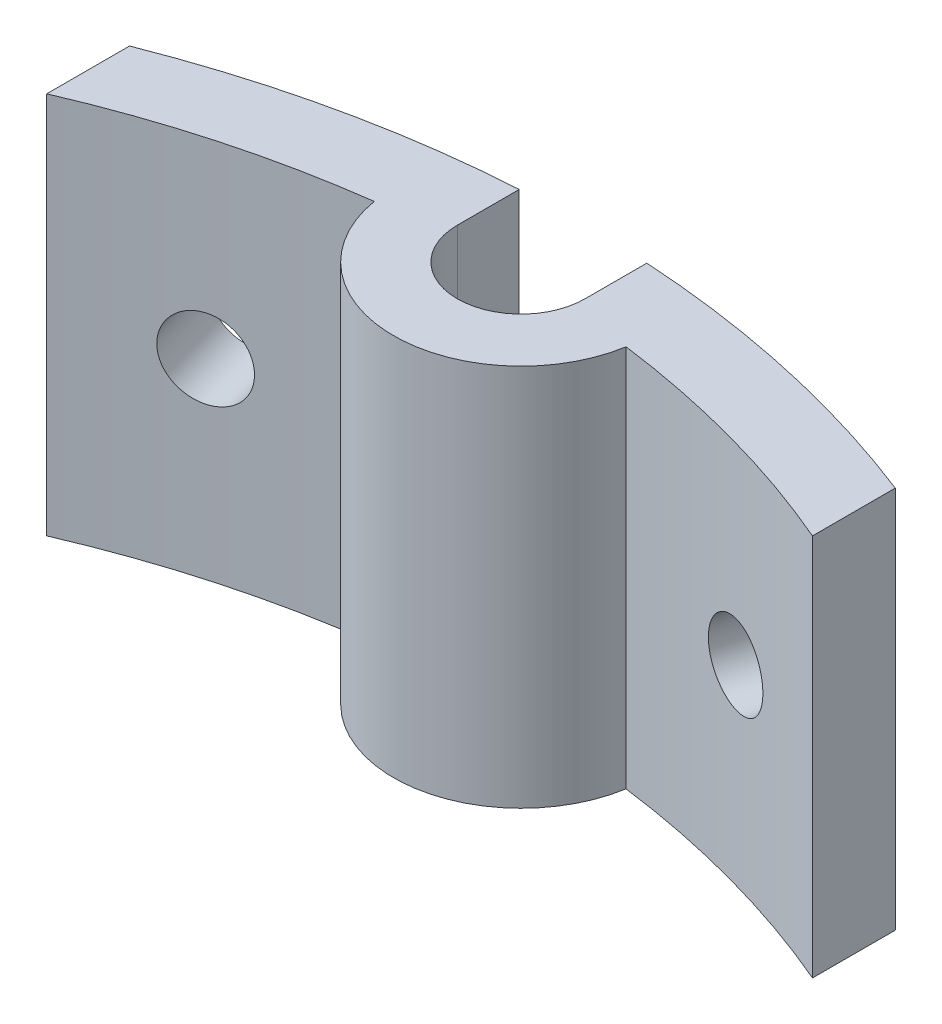
ISO-10303-21;
HEADER;
FILE_DESCRIPTION(('STEP AP214'),'2;1');
FILE_NAME('part.step','',(''),(''),'','','');
FILE_SCHEMA(('AUTOMOTIVE_DESIGN { 1 0 10303 214 1 1 1 1 }'));
ENDSEC;
DATA;
#1=APPLICATION_CONTEXT('core data for automotive mechanical design processes');
#2=APPLICATION_PROTOCOL_DEFINITION('international standard','automotive_design',2000,#1);
#3=PRODUCT_CONTEXT('',#1,'mechanical');
#4=PRODUCT('Part','Part','',(#3));
#5=PRODUCT_RELATED_PRODUCT_CATEGORY('part','',(#4));
#6=PRODUCT_DEFINITION_FORMATION('','',#4);
#7=PRODUCT_DEFINITION_CONTEXT('part definition',#1,'design');
#8=PRODUCT_DEFINITION('design','',#6,#7);
#9=PRODUCT_DEFINITION_SHAPE('','',#8);
#10=(LENGTH_UNIT() NAMED_UNIT(*) SI_UNIT(.MILLI.,.METRE.));
#11=(NAMED_UNIT(*) PLANE_ANGLE_UNIT() SI_UNIT($,.RADIAN.));
#12=(NAMED_UNIT(*) SI_UNIT($,.STERADIAN.) SOLID_ANGLE_UNIT());
#13=UNCERTAINTY_MEASURE_WITH_UNIT(LENGTH_MEASURE(1.E-05),#10,'distance_accuracy_value','');
#14=(GEOMETRIC_REPRESENTATION_CONTEXT(3) GLOBAL_UNCERTAINTY_ASSIGNED_CONTEXT((#13)) GLOBAL_UNIT_ASSIGNED_CONTEXT((#10,
#11,#12)) REPRESENTATION_CONTEXT('',''));
#15=CARTESIAN_POINT('',(0.,0.,0.));
#16=DIRECTION('',(0.,0.,1.));
#17=DIRECTION('',(1.,0.,0.));
#18=AXIS2_PLACEMENT_3D('',#15,#16,#17);
#19=CARTESIAN_POINT('',(0.,15.,0.));
#20=DIRECTION('',(0.,-1.,0.));
#21=DIRECTION('',(0.,0.,-1.));
#22=AXIS2_PLACEMENT_3D('',#19,#20,#21);
#23=CYLINDRICAL_SURFACE('',#22,41.);
#24=CARTESIAN_POINT('',(-12.6932776888419,7.5,-38.9856473784129));
#25=CARTESIAN_POINT('',(-12.6932740943222,7.41296920330301,-38.9856488107161));
#26=CARTESIAN_POINT('',(-12.6862799488873,7.32587609288315,-38.9879279146434));
#27=CARTESIAN_POINT('',(-12.6584708925541,7.15409075191891,-38.9969655252901));
#28=CARTESIAN_POINT('',(-12.6376395469426,7.06940150135863,-39.0037293585928));
#29=CARTESIAN_POINT('',(-12.5827331176201,6.90493733147452,-39.0214768421287));
#30=CARTESIAN_POINT('',(-12.5486646029322,6.82515999729659,-39.0324583992604));
#31=CARTESIAN_POINT('',(-12.4682318097364,6.67276484779085,-39.0582253849336));
#32=CARTESIAN_POINT('',(-12.4218704999239,6.60014530966438,-39.0730098950408));
#33=CARTESIAN_POINT('',(-12.3180986526609,6.46405856421499,-39.1058486686417));
#34=CARTESIAN_POINT('',(-12.260682039252,6.4005964234765,-39.1239047298457));
#35=CARTESIAN_POINT('',(-12.1364022322613,6.28466884951612,-39.1626348478834));
#36=CARTESIAN_POINT('',(-12.0695386595797,6.23220385781203,-39.1833090097762));
#37=CARTESIAN_POINT('',(-11.9282041220886,6.13974881672786,-39.2265649945904));
#38=CARTESIAN_POINT('',(-11.8537310249329,6.09976227686444,-39.2491473519194));
#39=CARTESIAN_POINT('',(-11.6992749179023,6.03342186665954,-39.2954636093574));
#40=CARTESIAN_POINT('',(-11.6192919365982,6.007067925634,-39.319197503495));
#41=CARTESIAN_POINT('',(-11.456105221743,5.96875298891944,-39.3670531759616));
#42=CARTESIAN_POINT('',(-11.3729030601335,5.95678505778418,-39.3911747616971));
#43=CARTESIAN_POINT('',(-11.20559540684,5.94756048177393,-39.4390948495184));
#44=CARTESIAN_POINT('',(-11.1214899199222,5.95030375931665,-39.4628933533072));
#45=CARTESIAN_POINT('',(-10.9548107113,5.97041792427225,-39.5094875810396));
#46=CARTESIAN_POINT('',(-10.8722362288513,5.9877813365228,-39.5322838111717));
#47=CARTESIAN_POINT('',(-10.7109322736086,6.03663131288564,-39.5762924457383));
#48=CARTESIAN_POINT('',(-10.6322028118191,6.06811791741597,-39.59750484564));
#49=CARTESIAN_POINT('',(-10.4808263159061,6.14432904955599,-39.6378408092884));
#50=CARTESIAN_POINT('',(-10.4081808590665,6.1890569964503,-39.6569638317511));
#51=CARTESIAN_POINT('',(-10.2710858949767,6.29047863153095,-39.6926922892367));
#52=CARTESIAN_POINT('',(-10.2066364194144,6.34717236597796,-39.7092977145259));
#53=CARTESIAN_POINT('',(-10.0877586593774,6.47095854140619,-39.7396640684885));
#54=CARTESIAN_POINT('',(-10.0333366710453,6.53805746732832,-39.7534232106745));
#55=CARTESIAN_POINT('',(-9.93614543448759,6.68072649316881,-39.7778271532198));
#56=CARTESIAN_POINT('',(-9.89337618850272,6.75629659471609,-39.7884719529802));
#57=CARTESIAN_POINT('',(-9.82073872359414,6.91376658573379,-39.8064630192458));
#58=CARTESIAN_POINT('',(-9.79087072124022,6.99566658143528,-39.8138092303785));
#59=CARTESIAN_POINT('',(-9.74491314036393,7.1634698132238,-39.8250829575696));
#60=CARTESIAN_POINT('',(-9.72882350247687,7.2493730320611,-39.8290104883576));
#61=CARTESIAN_POINT('',(-9.71090156025898,7.42268726695,-39.8333839614887));
#62=CARTESIAN_POINT('',(-9.70906043597044,7.5100973166659,-39.8338320576336));
#63=CARTESIAN_POINT('',(-9.71966645828371,7.68399400371782,-39.8312454310651));
#64=CARTESIAN_POINT('',(-9.73211357819193,7.77048064277866,-39.8282107148583));
#65=CARTESIAN_POINT('',(-9.77092427789576,7.94005009710696,-39.8187070810392));
#66=CARTESIAN_POINT('',(-9.79728384265254,8.02313388696332,-39.8122391542255));
#67=CARTESIAN_POINT('',(-9.86314438596352,8.18356915630723,-39.7959737504565));
#68=CARTESIAN_POINT('',(-9.90264540742929,8.26092061707566,-39.786176262629));
#69=CARTESIAN_POINT('',(-9.99365852589333,8.40773727871507,-39.7634126098797));
#70=CARTESIAN_POINT('',(-10.0451765274076,8.47719857774382,-39.750444887119));
#71=CARTESIAN_POINT('',(-10.1587152908784,8.60622395254846,-39.7215800990428));
#72=CARTESIAN_POINT('',(-10.2207360929526,8.66578799051798,-39.7056830225379));
#73=CARTESIAN_POINT('',(-10.3535191669577,8.77335838962047,-39.671265901518));
#74=CARTESIAN_POINT('',(-10.4242858386643,8.82135889739649,-39.6527445361127));
#75=CARTESIAN_POINT('',(-10.5724937618152,8.90439966932493,-39.6134856404986));
#76=CARTESIAN_POINT('',(-10.6499349935617,8.93943997172349,-39.59274811683));
#77=CARTESIAN_POINT('',(-10.8092442509176,8.99555540384067,-39.5495517370209));
#78=CARTESIAN_POINT('',(-10.8911110730988,9.01663430955452,-39.5270933481401));
#79=CARTESIAN_POINT('',(-11.0569471500589,9.04424097096257,-39.4810248438103));
#80=CARTESIAN_POINT('',(-11.1409163996839,9.05076876232489,-39.4574147311847));
#81=CARTESIAN_POINT('',(-11.3085119273078,9.04908747118955,-39.4097087601274));
#82=CARTESIAN_POINT('',(-11.3921383867972,9.04088759258394,-39.3856132143659));
#83=CARTESIAN_POINT('',(-11.5567343350998,9.01000269645623,-39.3376313884482));
#84=CARTESIAN_POINT('',(-11.6377038187227,8.98731765063964,-39.3137451087009));
#85=CARTESIAN_POINT('',(-11.7947092429782,8.92810796094027,-39.2669269303317));
#86=CARTESIAN_POINT('',(-11.8707451123322,8.89158311715824,-39.2439950455003));
#87=CARTESIAN_POINT('',(-12.0157547342817,8.80573290441396,-39.1998391614102));
#88=CARTESIAN_POINT('',(-12.0847287293487,8.75640797515214,-39.1786151035181));
#89=CARTESIAN_POINT('',(-12.2137349756549,8.64632724556695,-39.1385902959792));
#90=CARTESIAN_POINT('',(-12.2737625789006,8.58556554023827,-39.1197908066669));
#91=CARTESIAN_POINT('',(-12.3831850113173,8.45433037855167,-39.0852917362146));
#92=CARTESIAN_POINT('',(-12.4325772096352,8.38385452628498,-39.0695929221601));
#93=CARTESIAN_POINT('',(-12.5193767433758,8.23515489943092,-39.0418658655139));
#94=CARTESIAN_POINT('',(-12.5567750574187,8.15692535040786,-39.0298403861975));
#95=CARTESIAN_POINT('',(-12.6184692830087,7.99503966568907,-39.0099383964089));
#96=CARTESIAN_POINT('',(-12.6427807700006,7.91139011417551,-39.0020569541218));
#97=CARTESIAN_POINT('',(-12.6712123189035,7.77267916038253,-38.9928262867207));
#98=CARTESIAN_POINT('',(-12.6794766481556,7.71851750278245,-38.9901385756715));
#99=CARTESIAN_POINT('',(-12.6905104635212,7.60957879905299,-38.9865486709941));
#100=CARTESIAN_POINT('',(-12.6932799522473,7.55480175321623,-38.9856464765168));
#101=CARTESIAN_POINT('',(-12.6932776888419,7.5,-38.9856473784129));
#102=B_SPLINE_CURVE_WITH_KNOTS('',3,(#24,#25,#26,#27,#28,#29,#30,#31,#32,#33,#34,#35,#36,#37,
#38,#39,#40,#41,#42,#43,#44,#45,#46,#47,#48,#49,#50,#51,#52,#53,#54,#55,#56,#57,#58,#59,#60,#61,
#62,#63,#64,#65,#66,#67,#68,#69,#70,#71,#72,#73,#74,#75,#76,#77,#78,#79,#80,#81,#82,#83,#84,#85,
#86,#87,#88,#89,#90,#91,#92,#93,#94,#95,#96,#97,#98,#99,#100,#101),.UNSPECIFIED.,.T.,.F.,(4,2,2,
2,2,2,2,2,2,2,2,2,2,2,2,2,2,2,2,2,2,2,2,2,2,2,2,2,2,2,2,2,2,2,2,2,2,2,4),(0.,0.260892351985126,
0.522095126306809,0.783168442430555,1.04417876699429,1.30533295356009,1.56649762303791,
1.82773567801621,2.08897237847994,2.35008308704713,2.61119241859998,2.87216832797188,
3.1331449842148,3.39418909079418,3.65523420660912,3.9164426751835,4.17765119398579,
4.43886409745625,4.70007587547375,4.96112594811477,5.22217553305726,5.48314982199075,
5.74412496310752,6.00522860488978,6.26633324403448,6.52756977562868,6.7888055362961,
7.04997061433425,7.31113505219604,7.57213633505828,7.8331381277468,8.09414369043597,
8.35514028841371,8.61627201495139,8.87746826296102,9.13886051536125,9.39994097690464,
9.56422035421011,9.72849965340197),.UNSPECIFIED.);
#103=CARTESIAN_POINT('',(-12.6932776888419,7.5,-38.9856473784129));
#104=VERTEX_POINT('',#103);
#105=EDGE_CURVE('E11',#104,#104,#102,.T.);
#106=ORIENTED_EDGE('',*,*,#105,.T.);
#107=EDGE_LOOP('',(#106));
#108=FACE_BOUND('',#107,.T.);
#109=CARTESIAN_POINT('',(0.,0.,0.));
#110=DIRECTION('',(0.,1.,0.));
#111=DIRECTION('',(0.,0.,-1.));
#112=AXIS2_PLACEMENT_3D('',#109,#110,#111);
#113=CIRCLE('',#112,41.);
#114=CARTESIAN_POINT('',(-2.5,0.,-40.9237095092808));
#115=VERTEX_POINT('',#114);
#116=CARTESIAN_POINT('',(-15.,0.,-38.1575680566778));
#117=VERTEX_POINT('',#116);
#118=EDGE_CURVE('E148',#115,#117,#113,.T.);
#119=ORIENTED_EDGE('',*,*,#118,.T.);
#120=DIRECTION('',(0.,-1.,0.));
#121=VECTOR('',#120,1.);
#122=CARTESIAN_POINT('',(-15.,15.,-38.1575680566778));
#123=LINE('',#122,#121);
#124=CARTESIAN_POINT('',(-15.,15.,-38.1575680566778));
#125=VERTEX_POINT('',#124);
#126=EDGE_CURVE('E187',#125,#117,#123,.T.);
#127=ORIENTED_EDGE('',*,*,#126,.F.);
#128=CARTESIAN_POINT('',(0.,15.,0.));
#129=DIRECTION('',(0.,1.,0.));
#130=DIRECTION('',(0.,0.,-1.));
#131=AXIS2_PLACEMENT_3D('',#128,#129,#130);
#132=CIRCLE('',#131,41.);
#133=CARTESIAN_POINT('',(-2.5,15.,-40.9237095092808));
#134=VERTEX_POINT('',#133);
#135=EDGE_CURVE('E168',#134,#125,#132,.T.);
#136=ORIENTED_EDGE('',*,*,#135,.F.);
#137=DIRECTION('',(0.,-1.,0.));
#138=VECTOR('',#137,1.);
#139=CARTESIAN_POINT('',(-2.5,15.,-40.9237095092808));
#140=LINE('',#139,#138);
#141=EDGE_CURVE('E144',#134,#115,#140,.T.);
#142=ORIENTED_EDGE('',*,*,#141,.T.);
#143=EDGE_LOOP('',(#119,#127,#136,#142));
#144=FACE_BOUND('',#143,.T.);
#145=ADVANCED_FACE('F35',(#108,#144),#23,.T.);
#146=CARTESIAN_POINT('',(-15.,15.,-38.1575680566778));
#147=DIRECTION('',(1.,0.,0.));
#148=DIRECTION('',(0.,0.,-1.));
#149=AXIS2_PLACEMENT_3D('',#146,#147,#148);
#150=PLANE('',#149);
#151=DIRECTION('',(0.,0.,1.));
#152=VECTOR('',#151,1.);
#153=CARTESIAN_POINT('',(-15.,0.,-38.1575680566778));
#154=LINE('',#153,#152);
#155=CARTESIAN_POINT('',(-15.,0.,-34.9141805001922));
#156=VERTEX_POINT('',#155);
#157=EDGE_CURVE('E151',#117,#156,#154,.T.);
#158=ORIENTED_EDGE('',*,*,#157,.T.);
#159=DIRECTION('',(0.,-1.,0.));
#160=VECTOR('',#159,1.);
#161=CARTESIAN_POINT('',(-15.,15.,-34.9141805001922));
#162=LINE('',#161,#160);
#163=CARTESIAN_POINT('',(-15.,15.,-34.9141805001922));
#164=VERTEX_POINT('',#163);
#165=EDGE_CURVE('E184',#164,#156,#162,.T.);
#166=ORIENTED_EDGE('',*,*,#165,.F.);
#167=DIRECTION('',(0.,0.,1.));
#168=VECTOR('',#167,1.);
#169=CARTESIAN_POINT('',(-15.,15.,-38.1575680566778));
#170=LINE('',#169,#168);
#171=EDGE_CURVE('E105',#125,#164,#170,.T.);
#172=ORIENTED_EDGE('',*,*,#171,.F.);
#173=ORIENTED_EDGE('',*,*,#126,.T.);
#174=EDGE_LOOP('',(#158,#166,#172,#173));
#175=FACE_BOUND('',#174,.T.);
#176=ADVANCED_FACE('F231',(#175),#150,.F.);
#177=CARTESIAN_POINT('',(0.,15.,0.));
#178=DIRECTION('',(0.,-1.,0.));
#179=DIRECTION('',(0.,0.,-1.));
#180=AXIS2_PLACEMENT_3D('',#177,#178,#179);
#181=CYLINDRICAL_SURFACE('',#180,38.);
#182=CARTESIAN_POINT('',(-11.8723745494248,7.5,-36.0977384687486));
#183=CARTESIAN_POINT('',(-11.8723709652763,7.58702531627144,-36.0977399302551));
#184=CARTESIAN_POINT('',(-11.8653837479687,7.67411281230455,-36.1000400349502));
#185=CARTESIAN_POINT('',(-11.8376019343019,7.84588670305372,-36.1091593083377));
#186=CARTESIAN_POINT('',(-11.8167909520593,7.93057012375446,-36.115983840003));
#187=CARTESIAN_POINT('',(-11.7619370288759,8.0950226039705,-36.1338852727202));
#188=CARTESIAN_POINT('',(-11.7279006910088,8.17479409289616,-36.144960051701));
#189=CARTESIAN_POINT('',(-11.6475409986533,8.32717870992631,-36.1709353366461));
#190=CARTESIAN_POINT('',(-11.601220596216,8.3997935521408,-36.1858349234222));
#191=CARTESIAN_POINT('',(-11.4975313500649,8.53587800681484,-36.2189139437223));
#192=CARTESIAN_POINT('',(-11.440155624859,8.59934187992197,-36.237095419642));
#193=CARTESIAN_POINT('',(-11.3159559204713,8.71527417701227,-36.2760715732782));
#194=CARTESIAN_POINT('',(-11.2491315607472,8.76774215792601,-36.2968663562415));
#195=CARTESIAN_POINT('',(-11.1078656449504,8.86020680826592,-36.3403463927313));
#196=CARTESIAN_POINT('',(-11.0334215805399,8.90019935324139,-36.3630322683294));
#197=CARTESIAN_POINT('',(-10.8790129853868,8.96655131598373,-36.4095258246464));
#198=CARTESIAN_POINT('',(-10.79904848615,8.99291081154895,-36.4333334989627));
#199=CARTESIAN_POINT('',(-10.6358926360269,9.03123421521328,-36.4812967140164));
#200=CARTESIAN_POINT('',(-10.552703122772,9.04320620047547,-36.5054520518594));
#201=CARTESIAN_POINT('',(-10.3854078784915,9.05243965418073,-36.5533975674633));
#202=CARTESIAN_POINT('',(-10.3013021528219,9.04970120857266,-36.5771877473569));
#203=CARTESIAN_POINT('',(-10.1346172190866,9.029598278333,-36.6237220791257));
#204=CARTESIAN_POINT('',(-10.0520371326735,9.01224249557375,-36.6464668448548));
#205=CARTESIAN_POINT('',(-9.89071056252407,8.96341103592015,-36.690337110367));
#206=CARTESIAN_POINT('',(-9.81196409088367,8.93193531447764,-36.7114626050412));
#207=CARTESIAN_POINT('',(-9.66054084150256,8.85574750068426,-36.75159989349));
#208=CARTESIAN_POINT('',(-9.58786589591894,8.81103143126238,-36.7706110498063));
#209=CARTESIAN_POINT('',(-9.45070556519534,8.70963516871442,-36.8061026354618));
#210=CARTESIAN_POINT('',(-9.38622021745501,8.65295492095436,-36.8225830532438));
#211=CARTESIAN_POINT('',(-9.26726136623228,8.52919002225526,-36.8527019806289));
#212=CARTESIAN_POINT('',(-9.2127951900412,8.46209782236178,-36.8663384113144));
#213=CARTESIAN_POINT('',(-9.11551850113775,8.31944009150533,-36.8905115569792));
#214=CARTESIAN_POINT('',(-9.07270799083074,8.24387455879375,-36.9010482713189));
#215=CARTESIAN_POINT('',(-8.99999483712286,8.08641075210741,-36.9188502147449));
#216=CARTESIAN_POINT('',(-8.9700924515321,8.00451235168669,-36.9261153784898));
#217=CARTESIAN_POINT('',(-8.92407665062895,7.83670960786266,-36.937263315923));
#218=CARTESIAN_POINT('',(-8.90796316622097,7.75080528453513,-36.9411461065603));
#219=CARTESIAN_POINT('',(-8.89000720312553,7.57749550780915,-36.9454714282082));
#220=CARTESIAN_POINT('',(-8.88815444868269,7.49009118078179,-36.9459164363589));
#221=CARTESIAN_POINT('',(-8.89874755379751,7.31620422648518,-36.9433663938737));
#222=CARTESIAN_POINT('',(-8.91119338214117,7.22972159720427,-36.9403713507475));
#223=CARTESIAN_POINT('',(-8.95000979742467,7.06016252472534,-36.9309858926464));
#224=CARTESIAN_POINT('',(-8.97637570192538,6.97708494625602,-36.9245966194192));
#225=CARTESIAN_POINT('',(-9.04225458762052,6.81665932633596,-36.9085190028975));
#226=CARTESIAN_POINT('',(-9.08176761902924,6.73931130677014,-36.8988306470026));
#227=CARTESIAN_POINT('',(-9.17281131327489,6.59249180772596,-36.8763030227877));
#228=CARTESIAN_POINT('',(-9.22434884978267,6.5230248672608,-36.863461952034));
#229=CARTESIAN_POINT('',(-9.33792832428368,6.39398506151654,-36.83485462385));
#230=CARTESIAN_POINT('',(-9.39997030831145,6.33441223959956,-36.8190883536004));
#231=CARTESIAN_POINT('',(-9.53279998098714,6.22681635552246,-36.7849211103121));
#232=CARTESIAN_POINT('',(-9.60359279333194,6.17880010879961,-36.7665185927129));
#233=CARTESIAN_POINT('',(-9.75184995946425,6.09572696220404,-36.7274732423063));
#234=CARTESIAN_POINT('',(-9.82931429150557,6.0606700200917,-36.7068304168014));
#235=CARTESIAN_POINT('',(-9.98866036335314,6.00452256607581,-36.6637895927337));
#236=CARTESIAN_POINT('',(-10.0705407063846,5.98342766570326,-36.6413921481505));
#237=CARTESIAN_POINT('',(-10.2363954603395,5.95578872233021,-36.5954042285406));
#238=CARTESIAN_POINT('',(-10.3203698646658,5.94924463349572,-36.571813757272));
#239=CARTESIAN_POINT('',(-10.4879575750693,5.95089357144022,-36.524106164187));
#240=CARTESIAN_POINT('',(-10.5715710992716,5.95907588843405,-36.4999894376895));
#241=CARTESIAN_POINT('',(-10.7361325781745,5.98992328127629,-36.451924615298));
#242=CARTESIAN_POINT('',(-10.8170805277035,6.01258838522139,-36.4279765197312));
#243=CARTESIAN_POINT('',(-10.9740365664316,6.07175601490076,-36.3810010571435));
#244=CARTESIAN_POINT('',(-11.0500445905123,6.10825872299944,-36.3579737022615));
#245=CARTESIAN_POINT('',(-11.1949961809329,6.19406300165727,-36.3136036927578));
#246=CARTESIAN_POINT('',(-11.2639399841613,6.24336414284328,-36.2922609816496));
#247=CARTESIAN_POINT('',(-11.392894660668,6.35340224976613,-36.2519865083452));
#248=CARTESIAN_POINT('',(-11.4528999722915,6.41414628264646,-36.2330562482594));
#249=CARTESIAN_POINT('',(-11.5622823777341,6.54534870335935,-36.1983000927667));
#250=CARTESIAN_POINT('',(-11.6116568443087,6.61580948549043,-36.1824749648294));
#251=CARTESIAN_POINT('',(-11.6984310369473,6.76448606940571,-36.1545128282809));
#252=CARTESIAN_POINT('',(-11.7358212007639,6.84270799895053,-36.1423787651533));
#253=CARTESIAN_POINT('',(-11.7975085783218,7.00458336031184,-36.122290261607));
#254=CARTESIAN_POINT('',(-11.8218213346029,7.08823021144343,-36.1143308598716));
#255=CARTESIAN_POINT('',(-11.8502759179158,7.22700112448675,-36.1050008279273));
#256=CARTESIAN_POINT('',(-11.858552705421,7.2812253262943,-36.1022819517123));
#257=CARTESIAN_POINT('',(-11.869603149487,7.39029144703446,-36.0986503119099));
#258=CARTESIAN_POINT('',(-11.8723768091141,7.44513336562288,-36.0977375473162));
#259=CARTESIAN_POINT('',(-11.8723745494248,7.5,-36.0977384687486));
#260=B_SPLINE_CURVE_WITH_KNOTS('',3,(#182,#183,#184,#185,#186,#187,#188,#189,#190,#191,#192,
#193,#194,#195,#196,#197,#198,#199,#200,#201,#202,#203,#204,#205,#206,#207,#208,#209,#210,#211,
#212,#213,#214,#215,#216,#217,#218,#219,#220,#221,#222,#223,#224,#225,#226,#227,#228,#229,#230,
#231,#232,#233,#234,#235,#236,#237,#238,#239,#240,#241,#242,#243,#244,#245,#246,#247,#248,#249,
#250,#251,#252,#253,#254,#255,#256,#257,#258,#259),.UNSPECIFIED.,.T.,.F.,(4,2,2,2,2,2,2,2,2,2,2,
2,2,2,2,2,2,2,2,2,2,2,2,2,2,2,2,2,2,2,2,2,2,2,2,2,2,2,4),(0.,0.260875671850712,
0.522061123611222,0.783116339526818,1.04410887659001,1.30526439887587,1.5664304421626,
1.8276827371571,2.08893354127328,2.35003761030216,2.61114015377622,2.87208736962125,
3.13303540875581,3.39406190983891,3.65508960291545,3.91630744019161,4.17752533137475,
4.43874843954317,4.69997023872592,4.9610037934896,5.22203677841438,5.48298201288239,
5.74392824401912,6.00502400914453,6.26612091852214,6.52737143336083,6.78862109667106,
7.04978860643863,7.31095529354619,7.57193212380614,7.83290946036399,8.09389023643551,
8.35486225802457,8.61599598782433,8.87719417879363,9.13860026336128,9.39969497562102,
9.56416870227314,9.72864233728614),.UNSPECIFIED.);
#261=CARTESIAN_POINT('',(-11.8723745494248,7.5,-36.0977384687486));
#262=VERTEX_POINT('',#261);
#263=EDGE_CURVE('E214',#262,#262,#260,.T.);
#264=ORIENTED_EDGE('',*,*,#263,.T.);
#265=EDGE_LOOP('',(#264));
#266=FACE_BOUND('',#265,.T.);
#267=CARTESIAN_POINT('',(0.,0.,0.));
#268=DIRECTION('',(0.,-1.,0.));
#269=DIRECTION('',(0.,0.,-1.));
#270=AXIS2_PLACEMENT_3D('',#267,#268,#269);
#271=CIRCLE('',#270,38.);
#272=CARTESIAN_POINT('',(-4.93206397992168,0.,-37.6785714285714));
#273=VERTEX_POINT('',#272);
#274=EDGE_CURVE('E154',#156,#273,#271,.T.);
#275=ORIENTED_EDGE('',*,*,#274,.T.);
#276=DIRECTION('',(0.,-1.,0.));
#277=VECTOR('',#276,1.);
#278=CARTESIAN_POINT('',(-4.93206397992168,15.,-37.6785714285714));
#279=LINE('',#278,#277);
#280=CARTESIAN_POINT('',(-4.93206397992168,15.,-37.6785714285714));
#281=VERTEX_POINT('',#280);
#282=EDGE_CURVE('E181',#281,#273,#279,.T.);
#283=ORIENTED_EDGE('',*,*,#282,.F.);
#284=CARTESIAN_POINT('',(0.,15.,0.));
#285=DIRECTION('',(0.,-1.,0.));
#286=DIRECTION('',(0.,0.,-1.));
#287=AXIS2_PLACEMENT_3D('',#284,#285,#286);
#288=CIRCLE('',#287,38.);
#289=EDGE_CURVE('E245',#164,#281,#288,.T.);
#290=ORIENTED_EDGE('',*,*,#289,.F.);
#291=ORIENTED_EDGE('',*,*,#165,.T.);
#292=EDGE_LOOP('',(#275,#283,#290,#291));
#293=FACE_BOUND('',#292,.T.);
#294=ADVANCED_FACE('F227',(#266,#293),#181,.F.);
#295=CARTESIAN_POINT('',(0.,15.,-38.5));
#296=DIRECTION('',(0.,-1.,0.));
#297=DIRECTION('',(0.,0.,-1.));
#298=AXIS2_PLACEMENT_3D('',#295,#296,#297);
#299=CYLINDRICAL_SURFACE('',#298,5.);
#300=CARTESIAN_POINT('',(0.,0.,-38.5));
#301=DIRECTION('',(0.,1.,0.));
#302=DIRECTION('',(0.,0.,1.));
#303=AXIS2_PLACEMENT_3D('',#300,#301,#302);
#304=CIRCLE('',#303,5.);
#305=CARTESIAN_POINT('',(4.93206397992167,0.,-37.6785714285714));
#306=VERTEX_POINT('',#305);
#307=EDGE_CURVE('E157',#273,#306,#304,.T.);
#308=ORIENTED_EDGE('',*,*,#307,.T.);
#309=DIRECTION('',(0.,-1.,0.));
#310=VECTOR('',#309,1.);
#311=CARTESIAN_POINT('',(4.93206397992167,15.,-37.6785714285714));
#312=LINE('',#311,#310);
#313=CARTESIAN_POINT('',(4.93206397992167,15.,-37.6785714285714));
#314=VERTEX_POINT('',#313);
#315=EDGE_CURVE('E178',#314,#306,#312,.T.);
#316=ORIENTED_EDGE('',*,*,#315,.F.);
#317=CARTESIAN_POINT('',(0.,15.,-38.5));
#318=DIRECTION('',(0.,1.,0.));
#319=DIRECTION('',(0.,0.,-1.));
#320=AXIS2_PLACEMENT_3D('',#317,#318,#319);
#321=CIRCLE('',#320,5.);
#322=EDGE_CURVE('E256',#281,#314,#321,.T.);
#323=ORIENTED_EDGE('',*,*,#322,.F.);
#324=ORIENTED_EDGE('',*,*,#282,.T.);
#325=EDGE_LOOP('',(#308,#316,#323,#324));
#326=FACE_BOUND('',#325,.T.);
#327=ADVANCED_FACE('F224',(#326),#299,.T.);
#328=CARTESIAN_POINT('',(0.,15.,0.));
#329=DIRECTION('',(0.,-1.,0.));
#330=DIRECTION('',(0.,0.,-1.));
#331=AXIS2_PLACEMENT_3D('',#328,#329,#330);
#332=CYLINDRICAL_SURFACE('',#331,38.);
#333=CARTESIAN_POINT('',(8.890503760584,7.5,-36.9453507614022));
#334=CARTESIAN_POINT('',(8.89050757759311,7.58702531627144,-36.9453501190911));
#335=CARTESIAN_POINT('',(8.89765993618632,7.67411281230455,-36.9436309757385));
#336=CARTESIAN_POINT('',(8.92608461008965,7.84588670305372,-36.9367732624741));
#337=CARTESIAN_POINT('',(8.94737368222452,7.93057012375446,-36.9316306345477));
#338=CARTESIAN_POINT('',(9.00344211646426,8.0950226039705,-36.9180018098058));
#339=CARTESIAN_POINT('',(9.03821474656391,8.17479409289616,-36.9095172814847));
#340=CARTESIAN_POINT('',(9.12022222549975,8.32717870992631,-36.8893388528534));
#341=CARTESIAN_POINT('',(9.16745408017677,8.3997935521408,-36.8776457235963));
#342=CARTESIAN_POINT('',(9.27303948789473,8.53587800681484,-36.8512373342393));
#343=CARTESIAN_POINT('',(9.33139996782015,8.59934187992197,-36.8365201914323));
#344=CARTESIAN_POINT('',(9.4575310388976,8.71527417701227,-36.8043385191466));
#345=CARTESIAN_POINT('',(9.52530200905386,8.76774215792601,-36.7868738790097));
#346=CARTESIAN_POINT('',(9.66831662114903,8.86020680826593,-36.7495456957386));
#347=CARTESIAN_POINT('',(9.74356272359247,8.90019935324139,-36.7296813622567));
#348=CARTESIAN_POINT('',(9.89934005015086,8.96655131598373,-36.6880029557795));
#349=CARTESIAN_POINT('',(9.97987124410295,8.99291081154895,-36.6661888939113));
#350=CARTESIAN_POINT('',(10.143860983442,9.03123421521328,-36.621159272336));
#351=CARTESIAN_POINT('',(10.2273178592371,9.04320620047547,-36.597944506681));
#352=CARTESIAN_POINT('',(10.3948187578766,9.05243965418073,-36.5507224760136));
#353=CARTESIAN_POINT('',(10.4788627772876,9.04970120857266,-36.5267152156323));
#354=CARTESIAN_POINT('',(10.6451023248521,9.029598278333,-36.4786140306876));
#355=CARTESIAN_POINT('',(10.7272989229141,9.01224249557375,-36.454520166176));
#356=CARTESIAN_POINT('',(10.8875799715454,8.96341103592015,-36.4069717920511));
#357=CARTESIAN_POINT('',(10.9656644091401,8.93193531447764,-36.3835172844551));
#358=CARTESIAN_POINT('',(11.1155593104328,8.85574750068426,-36.3380033201848));
#359=CARTESIAN_POINT('',(11.1873678806106,8.81103143126238,-36.3159442850953));
#360=CARTESIAN_POINT('',(11.3226887850768,8.70963516871442,-36.2739816613569));
#361=CARTESIAN_POINT('',(11.3862010814783,8.65295492095437,-36.2540780825515));
#362=CARTESIAN_POINT('',(11.5032159396664,8.52919002225526,-36.2171202547706));
#363=CARTESIAN_POINT('',(11.5567111762147,8.46209782236178,-36.2000680919353));
#364=CARTESIAN_POINT('',(11.6521582714277,8.31944009150533,-36.1694584988191));
#365=CARTESIAN_POINT('',(11.6941101277103,8.24387455879375,-36.1559010692594));
#366=CARTESIAN_POINT('',(11.7653151369788,8.08641075210741,-36.1327935257515));
#367=CARTESIAN_POINT('',(11.7945680363323,8.00451235168669,-36.1232434918419));
#368=CARTESIAN_POINT('',(11.8395674346389,7.83670960786266,-36.1085198851569));
#369=CARTESIAN_POINT('',(11.8553140012716,7.75080528453513,-36.1033462904512));
#370=CARTESIAN_POINT('',(11.8728603330552,7.57749550780915,-36.0975798999869));
#371=CARTESIAN_POINT('',(11.8746701405203,7.49009118078179,-36.0969838058512));
#372=CARTESIAN_POINT('',(11.8643195793395,7.31620422648518,-36.1003871095244));
#373=CARTESIAN_POINT('',(11.8521592411905,7.22972159720427,-36.1043864973012));
#374=CARTESIAN_POINT('',(11.8142098507967,7.06016252472534,-36.1168221190374));
#375=CARTESIAN_POINT('',(11.7884253814386,6.97708494625602,-36.1252568610272));
#376=CARTESIAN_POINT('',(11.7239397865912,6.81665932633596,-36.1462360266595));
#377=CARTESIAN_POINT('',(11.6852386117676,6.73931130677014,-36.1587804659986));
#378=CARTESIAN_POINT('',(11.5959581080574,6.59249180772596,-36.1875109336576));
#379=CARTESIAN_POINT('',(11.54537198516,6.5230248672608,-36.2036990446532));
#380=CARTESIAN_POINT('',(11.4337272897981,6.39398506151654,-36.2391128590664));
#381=CARTESIAN_POINT('',(11.3726686714389,6.33441223959956,-36.2583385757958));
#382=CARTESIAN_POINT('',(11.2417275175291,6.22681635552246,-36.2991495629171));
#383=CARTESIAN_POINT('',(11.1718398119281,6.17880010879961,-36.3207362147996));
#384=CARTESIAN_POINT('',(11.0252119677175,6.09572696220404,-36.365513463488));
#385=CARTESIAN_POINT('',(10.9484718514437,6.06067002009171,-36.3887040550657));
#386=CARTESIAN_POINT('',(10.7903114689347,6.00452256607581,-36.4359160933006));
#387=CARTESIAN_POINT('',(10.7088926820256,5.98342766570326,-36.4599372763909));
#388=CARTESIAN_POINT('',(10.5436466026252,5.95578872233021,-36.508066492074));
#389=CARTESIAN_POINT('',(10.4598193177214,5.94924463349572,-36.532174524393));
#390=CARTESIAN_POINT('',(10.2921948319183,5.95089357144022,-36.5797527428917));
#391=CARTESIAN_POINT('',(10.2083976534491,5.95907588843405,-36.6032233800175));
#392=CARTESIAN_POINT('',(10.0431590095101,5.98992328127629,-36.6489059591853));
#393=CARTESIAN_POINT('',(9.96171754861068,6.01258838522139,-36.6711178987853));
#394=CARTESIAN_POINT('',(9.80352018708675,6.07175601490076,-36.7137264306232));
#395=CARTESIAN_POINT('',(9.72676434822906,6.10825872299944,-36.734122998932));
#396=CARTESIAN_POINT('',(9.58014701260373,6.19406300165727,-36.7726329743014));
#397=CARTESIAN_POINT('',(9.51028528465485,6.24336414284327,-36.7907464579265));
#398=CARTESIAN_POINT('',(9.37942728081271,6.35340224976613,-36.8243250913614));
#399=CARTESIAN_POINT('',(9.31843652511492,6.41414628264646,-36.8397885932079));
#400=CARTESIAN_POINT('',(9.20712701564556,6.54534870335935,-36.8677652632516));
#401=CARTESIAN_POINT('',(9.15681089998677,6.61580948549043,-36.8802777022132));
#402=CARTESIAN_POINT('',(9.06830292023112,6.76448606940571,-36.9021404355286));
#403=CARTESIAN_POINT('',(9.03012073797756,6.84270799895053,-36.9114882051327));
#404=CARTESIAN_POINT('',(8.96709017411045,7.00458336031183,-36.9268514256054));
#405=CARTESIAN_POINT('',(8.94222596419312,7.08823021144342,-36.9328708324827));
#406=CARTESIAN_POINT('',(8.91311825281082,7.22700112448675,-36.9399031824229));
#407=CARTESIAN_POINT('',(8.90464886402597,7.28122532629429,-36.9419444939838));
#408=CARTESIAN_POINT('',(8.89334041623096,7.39029144703445,-36.9446684855731));
#409=CARTESIAN_POINT('',(8.89050135408377,7.44513336562288,-36.9453511663585));
#410=CARTESIAN_POINT('',(8.890503760584,7.5,-36.9453507614022));
#411=B_SPLINE_CURVE_WITH_KNOTS('',3,(#333,#334,#335,#336,#337,#338,#339,#340,#341,#342,#343,
#344,#345,#346,#347,#348,#349,#350,#351,#352,#353,#354,#355,#356,#357,#358,#359,#360,#361,#362,
#363,#364,#365,#366,#367,#368,#369,#370,#371,#372,#373,#374,#375,#376,#377,#378,#379,#380,#381,
#382,#383,#384,#385,#386,#387,#388,#389,#390,#391,#392,#393,#394,#395,#396,#397,#398,#399,#400,
#401,#402,#403,#404,#405,#406,#407,#408,#409,#410),.UNSPECIFIED.,.T.,.F.,(4,2,2,2,2,2,2,2,2,2,2,
2,2,2,2,2,2,2,2,2,2,2,2,2,2,2,2,2,2,2,2,2,2,2,2,2,2,2,4),(0.,0.260875671850712,
0.522061123611222,0.783116339526818,1.04410887659001,1.30526439887587,1.5664304421626,
1.8276827371571,2.08893354127328,2.35003761030216,2.61114015377622,2.87208736962125,
3.13303540875581,3.39406190983891,3.65508960291545,3.91630744019161,4.17752533137475,
4.43874843954317,4.69997023872592,4.9610037934896,5.22203677841437,5.48298201288238,
5.74392824401911,6.00502400914453,6.26612091852214,6.52737143336083,6.78862109667106,
7.04978860643863,7.31095529354619,7.57193212380614,7.83290946036399,8.09389023643551,
8.35486225802457,8.61599598782433,8.87719417879363,9.13860026336128,9.39969497562102,
9.56416870227314,9.72864233728614),.UNSPECIFIED.);
#412=CARTESIAN_POINT('',(8.890503760584,7.5,-36.9453507614022));
#413=VERTEX_POINT('',#412);
#414=EDGE_CURVE('E152',#413,#413,#411,.T.);
#415=ORIENTED_EDGE('',*,*,#414,.T.);
#416=EDGE_LOOP('',(#415));
#417=FACE_BOUND('',#416,.T.);
#418=CARTESIAN_POINT('',(0.,0.,0.));
#419=DIRECTION('',(0.,-1.,0.));
#420=DIRECTION('',(0.,0.,1.));
#421=AXIS2_PLACEMENT_3D('',#418,#419,#420);
#422=CIRCLE('',#421,38.);
#423=CARTESIAN_POINT('',(15.,0.,-34.9141805001922));
#424=VERTEX_POINT('',#423);
#425=EDGE_CURVE('E159',#306,#424,#422,.T.);
#426=ORIENTED_EDGE('',*,*,#425,.T.);
#427=DIRECTION('',(0.,-1.,0.));
#428=VECTOR('',#427,1.);
#429=CARTESIAN_POINT('',(15.,15.,-34.9141805001922));
#430=LINE('',#429,#428);
#431=CARTESIAN_POINT('',(15.,15.,-34.9141805001922));
#432=VERTEX_POINT('',#431);
#433=EDGE_CURVE('E175',#432,#424,#430,.T.);
#434=ORIENTED_EDGE('',*,*,#433,.F.);
#435=CARTESIAN_POINT('',(0.,15.,0.));
#436=DIRECTION('',(0.,-1.,0.));
#437=DIRECTION('',(0.,0.,1.));
#438=AXIS2_PLACEMENT_3D('',#435,#436,#437);
#439=CIRCLE('',#438,38.);
#440=EDGE_CURVE('E253',#314,#432,#439,.T.);
#441=ORIENTED_EDGE('',*,*,#440,.F.);
#442=ORIENTED_EDGE('',*,*,#315,.T.);
#443=EDGE_LOOP('',(#426,#434,#441,#442));
#444=FACE_BOUND('',#443,.T.);
#445=ADVANCED_FACE('F219',(#417,#444),#332,.F.);
#446=CARTESIAN_POINT('',(15.,15.,-38.1575680566778));
#447=DIRECTION('',(-1.,0.,0.));
#448=DIRECTION('',(0.,0.,1.));
#449=AXIS2_PLACEMENT_3D('',#446,#447,#448);
#450=PLANE('',#449);
#451=DIRECTION('',(0.,0.,-1.));
#452=VECTOR('',#451,1.);
#453=CARTESIAN_POINT('',(15.,0.,-38.1575680566778));
#454=LINE('',#453,#452);
#455=CARTESIAN_POINT('',(15.,0.,-38.1575680566778));
#456=VERTEX_POINT('',#455);
#457=EDGE_CURVE('E161',#424,#456,#454,.T.);
#458=ORIENTED_EDGE('',*,*,#457,.T.);
#459=DIRECTION('',(0.,-1.,0.));
#460=VECTOR('',#459,1.);
#461=CARTESIAN_POINT('',(15.,15.,-38.1575680566778));
#462=LINE('',#461,#460);
#463=CARTESIAN_POINT('',(15.,15.,-38.1575680566778));
#464=VERTEX_POINT('',#463);
#465=EDGE_CURVE('E172',#464,#456,#462,.T.);
#466=ORIENTED_EDGE('',*,*,#465,.F.);
#467=DIRECTION('',(0.,0.,-1.));
#468=VECTOR('',#467,1.);
#469=CARTESIAN_POINT('',(15.,15.,-38.1575680566778));
#470=LINE('',#469,#468);
#471=EDGE_CURVE('E255',#432,#464,#470,.T.);
#472=ORIENTED_EDGE('',*,*,#471,.F.);
#473=ORIENTED_EDGE('',*,*,#433,.T.);
#474=EDGE_LOOP('',(#458,#466,#472,#473));
#475=FACE_BOUND('',#474,.T.);
#476=ADVANCED_FACE('F223',(#475),#450,.F.);
#477=CARTESIAN_POINT('',(0.,15.,0.));
#478=DIRECTION('',(0.,-1.,0.));
#479=DIRECTION('',(0.,0.,-1.));
#480=AXIS2_PLACEMENT_3D('',#477,#478,#479);
#481=CYLINDRICAL_SURFACE('',#480,41.);
#482=CARTESIAN_POINT('',(9.71140690000104,7.5,-39.8332596710665));
#483=CARTESIAN_POINT('',(9.71141071046942,7.41296920330301,-39.8332589984634));
#484=CARTESIAN_POINT('',(9.71855791471186,7.32587609288315,-39.8315183501378));
#485=CARTESIAN_POINT('',(9.74696280265398,7.15409075191891,-39.8245768545251));
#486=CARTESIAN_POINT('',(9.76823726556589,7.06940150135863,-39.8193718925903));
#487=CARTESIAN_POINT('',(9.82426937663228,6.90493733147452,-39.8055845185748));
#488=CARTESIAN_POINT('',(9.85902033697919,6.82515999729659,-39.7970037817158));
#489=CARTESIAN_POINT('',(9.94098041950654,6.67276484779085,-39.7766097471942));
#490=CARTESIAN_POINT('',(9.98818653376865,6.60014530966438,-39.7647972299807));
#491=CARTESIAN_POINT('',(10.0937158202482,6.46405856421499,-39.7381410668827));
#492=CARTESIAN_POINT('',(10.1520451055537,6.40059642347651,-39.7232957539085));
#493=CARTESIAN_POINT('',(10.2781148854528,6.28466884951612,-39.690862698779));
#494=CARTESIAN_POINT('',(10.3458557577249,6.23220385781203,-39.6732748465645));
#495=CARTESIAN_POINT('',(10.4888108780937,6.13974881672786,-39.6357200163769));
#496=CARTESIAN_POINT('',(10.5640272208096,6.09976227686444,-39.6157523712744));
#497=CARTESIAN_POINT('',(10.7197516945413,6.03342186665954,-39.5738981841108));
#498=CARTESIAN_POINT('',(10.8002597981172,6.007067925634,-39.5520116519997));
#499=CARTESIAN_POINT('',(10.9642192189706,5.96875298891944,-39.5068743325638));
#500=CARTESIAN_POINT('',(11.0476690980385,5.95678505778418,-39.4836242082968));
#501=CARTESIAN_POINT('',(11.2151671750605,5.94756048177393,-39.4363740245797));
#502=CARTESIAN_POINT('',(11.299215369857,5.95030375931665,-39.4123739690851));
#503=CARTESIAN_POINT('',(11.4654815541104,5.97041792427225,-39.3643267358797));
#504=CARTESIAN_POINT('',(11.5477004568242,5.9877813365228,-39.3402795885138));
#505=CARTESIAN_POINT('',(11.708035055228,6.03663131288564,-39.2928607900467));
#506=CARTESIAN_POINT('',(11.7861507391744,6.06811791741597,-39.2694891408788));
#507=CARTESIAN_POINT('',(11.9361103824295,6.14432904955599,-39.2241687384849));
#508=CARTESIAN_POINT('',(12.0079527155708,6.1890569964503,-39.2022203545726));
#509=CARTESIAN_POINT('',(12.1433426236341,6.29047863153095,-39.1604935688386));
#510=CARTESIAN_POINT('',(12.2068901664863,6.34717236597796,-39.1407151754066));
#511=CARTESIAN_POINT('',(12.3239662067501,6.47095854140619,-39.1040104334714));
#512=CARTESIAN_POINT('',(12.3774884097151,6.53805746732832,-39.0870858774213));
#513=CARTESIAN_POINT('',(12.472984230567,6.68072649316881,-39.0567175209432));
#514=CARTESIAN_POINT('',(12.5149578462333,6.75629659471609,-39.0432737211844));
#515=CARTESIAN_POINT('',(12.5861979639401,6.91376658573379,-39.0203668356948));
#516=CARTESIAN_POINT('',(12.6154642526661,6.99566658143527,-39.0109038167883));
#517=CARTESIAN_POINT('',(12.6604803025093,7.1634698132238,-38.996317815921));
#518=CARTESIAN_POINT('',(12.6762301218627,7.2493730320611,-38.9911948152609));
#519=CARTESIAN_POINT('',(12.6937728476758,7.42268726695,-38.9854872719071));
#520=CARTESIAN_POINT('',(12.6955743882455,7.5100973166659,-38.9848999216057));
#521=CARTESIAN_POINT('',(12.6851935977188,7.68399400371782,-38.9882789058253));
#522=CARTESIAN_POINT('',(12.6730112927474,7.77048064277866,-38.9922452318391));
#523=CARTESIAN_POINT('',(12.6350046019165,7.94005009710696,-39.0045773411214));
#524=CARTESIAN_POINT('',(12.6091841519331,8.02313388696332,-39.0129418550996));
#525=CARTESIAN_POINT('',(12.5446153792367,8.18356915630723,-39.0337516633029));
#526=CARTESIAN_POINT('',(12.5058670143093,8.26092061707566,-39.0461969708533));
#527=CARTESIAN_POINT('',(12.4164883616802,8.40773727871507,-39.0747106179938));
#528=CARTESIAN_POINT('',(12.3658522328731,8.47719857774382,-39.0907807384991));
#529=CARTESIAN_POINT('',(12.2541067353382,8.60622395254847,-39.1259541742401));
#530=CARTESIAN_POINT('',(12.1929973266054,8.66578799051798,-39.1450575010618));
#531=CARTESIAN_POINT('',(12.0619643661194,8.77335838962047,-39.1856314610339));
#532=CARTESIAN_POINT('',(11.9920363776483,8.82135889739649,-39.2071032851134));
#533=CARTESIAN_POINT('',(11.845338087006,8.90439966932493,-39.2516730157854));
#534=CARTESIAN_POINT('',(11.7685678050275,8.93943997172349,-39.2747709175789));
#535=CARTESIAN_POINT('',(11.6103569088587,8.99555540384067,-39.3218312941324));
#536=CARTESIAN_POINT('',(11.5289175639417,9.01663430955452,-39.3457935332735));
#537=CARTESIAN_POINT('',(11.363644980701,9.04424097096257,-39.3938443890585));
#538=CARTESIAN_POINT('',(11.2798117482458,9.05076876232489,-39.4179330053923));
#539=CARTESIAN_POINT('',(11.1121814672581,9.04908747118955,-39.4655167153155));
#540=CARTESIAN_POINT('',(11.028384428839,9.04088759258394,-39.48901217029));
#541=CARTESIAN_POINT('',(10.8631601262283,9.01000269645623,-39.5347834674407));
#542=CARTESIAN_POINT('',(10.7817328666662,8.98731765063964,-39.5570593072345));
#543=CARTESIAN_POINT('',(10.6235762365888,8.92810796094027,-39.5998275832584));
#544=CARTESIAN_POINT('',(10.5468469339486,8.89158311715824,-39.6203199937238));
#545=CARTESIAN_POINT('',(10.4002928754699,8.80573290441396,-39.6590426034125));
#546=CARTESIAN_POINT('',(10.3304678825726,8.75640797515214,-39.6772728803115));
#547=CARTESIAN_POINT('',(10.1996973459681,8.64632724556695,-39.7110909754782));
#548=CARTESIAN_POINT('',(10.1387564182299,8.58556554023827,-39.7266774207509));
#549=CARTESIAN_POINT('',(10.027548095534,8.45433037855167,-39.7548937908438));
#550=CARTESIAN_POINT('',(9.97728334155596,8.38385452628498,-39.7675229842035));
#551=CARTESIAN_POINT('',(9.88887746371771,8.23515489943093,-39.7895989777597));
#552=CARTESIAN_POINT('',(9.85074546586099,8.15692535040786,-39.7990433827434));
#553=CARTESIAN_POINT('',(9.78780718568604,7.99503966568907,-39.8145688314427));
#554=CARTESIAN_POINT('',(9.76298506259716,7.91139011417551,-39.8206538735662));
#555=CARTESIAN_POINT('',(9.73394920808941,7.77267916038253,-39.8277586147079));
#556=CARTESIAN_POINT('',(9.72550680793063,7.71851750278245,-39.829819878454));
#557=CARTESIAN_POINT('',(9.71423445552851,7.60957879905299,-39.8325706180703));
#558=CARTESIAN_POINT('',(9.71140450061651,7.55480175321623,-39.8332600945928));
#559=CARTESIAN_POINT('',(9.71140690000104,7.5,-39.8332596710665));
#560=B_SPLINE_CURVE_WITH_KNOTS('',3,(#482,#483,#484,#485,#486,#487,#488,#489,#490,#491,#492,
#493,#494,#495,#496,#497,#498,#499,#500,#501,#502,#503,#504,#505,#506,#507,#508,#509,#510,#511,
#512,#513,#514,#515,#516,#517,#518,#519,#520,#521,#522,#523,#524,#525,#526,#527,#528,#529,#530,
#531,#532,#533,#534,#535,#536,#537,#538,#539,#540,#541,#542,#543,#544,#545,#546,#547,#548,#549,
#550,#551,#552,#553,#554,#555,#556,#557,#558,#559),.UNSPECIFIED.,.T.,.F.,(4,2,2,2,2,2,2,2,2,2,2,
2,2,2,2,2,2,2,2,2,2,2,2,2,2,2,2,2,2,2,2,2,2,2,2,2,2,2,4),(0.,0.260892351985126,
0.522095126306809,0.783168442430555,1.04417876699429,1.30533295356009,1.56649762303791,
1.82773567801621,2.08897237847993,2.35008308704713,2.61119241859998,2.87216832797187,
3.1331449842148,3.39418909079418,3.65523420660912,3.9164426751835,4.17765119398578,
4.43886409745624,4.70007587547375,4.96112594811476,5.22217553305726,5.48314982199075,
5.74412496310751,6.00522860488978,6.26633324403448,6.52756977562868,6.7888055362961,
7.04997061433425,7.31113505219604,7.57213633505827,7.8331381277468,8.09414369043597,
8.3551402884137,8.61627201495138,8.87746826296101,9.13886051536124,9.39994097690464,
9.56422035421011,9.72849965340197),.UNSPECIFIED.);
#561=CARTESIAN_POINT('',(9.71140690000104,7.5,-39.8332596710665));
#562=VERTEX_POINT('',#561);
#563=EDGE_CURVE('E47',#562,#562,#560,.T.);
#564=ORIENTED_EDGE('',*,*,#563,.T.);
#565=EDGE_LOOP('',(#564));
#566=FACE_BOUND('',#565,.T.);
#567=CARTESIAN_POINT('',(0.,0.,0.));
#568=DIRECTION('',(0.,1.,0.));
#569=DIRECTION('',(0.,0.,-1.));
#570=AXIS2_PLACEMENT_3D('',#567,#568,#569);
#571=CIRCLE('',#570,41.);
#572=CARTESIAN_POINT('',(2.5,0.,-40.9237095092808));
#573=VERTEX_POINT('',#572);
#574=EDGE_CURVE('E163',#456,#573,#571,.T.);
#575=ORIENTED_EDGE('',*,*,#574,.T.);
#576=DIRECTION('',(0.,-1.,0.));
#577=VECTOR('',#576,1.);
#578=CARTESIAN_POINT('',(2.5,15.,-40.9237095092808));
#579=LINE('',#578,#577);
#580=CARTESIAN_POINT('',(2.5,15.,-40.9237095092808));
#581=VERTEX_POINT('',#580);
#582=EDGE_CURVE('E139',#581,#573,#579,.T.);
#583=ORIENTED_EDGE('',*,*,#582,.F.);
#584=CARTESIAN_POINT('',(0.,15.,0.));
#585=DIRECTION('',(0.,1.,0.));
#586=DIRECTION('',(0.,0.,-1.));
#587=AXIS2_PLACEMENT_3D('',#584,#585,#586);
#588=CIRCLE('',#587,41.);
#589=EDGE_CURVE('E130',#464,#581,#588,.T.);
#590=ORIENTED_EDGE('',*,*,#589,.F.);
#591=ORIENTED_EDGE('',*,*,#465,.T.);
#592=EDGE_LOOP('',(#575,#583,#590,#591));
#593=FACE_BOUND('',#592,.T.);
#594=ADVANCED_FACE('F193',(#566,#593),#481,.T.);
#595=CARTESIAN_POINT('',(2.5,15.,-38.5));
#596=DIRECTION('',(1.,0.,0.));
#597=DIRECTION('',(0.,0.,-1.));
#598=AXIS2_PLACEMENT_3D('',#595,#596,#597);
#599=PLANE('',#598);
#600=DIRECTION('',(0.,0.,1.));
#601=VECTOR('',#600,1.);
#602=CARTESIAN_POINT('',(2.5,0.,-38.5));
#603=LINE('',#602,#601);
#604=CARTESIAN_POINT('',(2.5,0.,-38.5));
#605=VERTEX_POINT('',#604);
#606=EDGE_CURVE('E138',#573,#605,#603,.T.);
#607=ORIENTED_EDGE('',*,*,#606,.T.);
#608=DIRECTION('',(0.,-1.,0.));
#609=VECTOR('',#608,1.);
#610=CARTESIAN_POINT('',(2.5,15.,-38.5));
#611=LINE('',#610,#609);
#612=CARTESIAN_POINT('',(2.5,15.,-38.5));
#613=VERTEX_POINT('',#612);
#614=EDGE_CURVE('E135',#613,#605,#611,.T.);
#615=ORIENTED_EDGE('',*,*,#614,.F.);
#616=DIRECTION('',(0.,0.,1.));
#617=VECTOR('',#616,1.);
#618=CARTESIAN_POINT('',(2.5,15.,-38.5));
#619=LINE('',#618,#617);
#620=EDGE_CURVE('E124',#581,#613,#619,.T.);
#621=ORIENTED_EDGE('',*,*,#620,.F.);
#622=ORIENTED_EDGE('',*,*,#582,.T.);
#623=EDGE_LOOP('',(#607,#615,#621,#622));
#624=FACE_BOUND('',#623,.T.);
#625=ADVANCED_FACE('F136',(#624),#599,.F.);
#626=CARTESIAN_POINT('',(0.,15.,-38.5));
#627=DIRECTION('',(0.,-1.,0.));
#628=DIRECTION('',(0.,0.,-1.));
#629=AXIS2_PLACEMENT_3D('',#626,#627,#628);
#630=CYLINDRICAL_SURFACE('',#629,2.5);
#631=CARTESIAN_POINT('',(0.,0.,-38.5));
#632=DIRECTION('',(0.,-1.,0.));
#633=DIRECTION('',(0.,0.,1.));
#634=AXIS2_PLACEMENT_3D('',#631,#632,#633);
#635=CIRCLE('',#634,2.5);
#636=CARTESIAN_POINT('',(-2.5,0.,-38.5));
#637=VERTEX_POINT('',#636);
#638=EDGE_CURVE('E90',#605,#637,#635,.T.);
#639=ORIENTED_EDGE('',*,*,#638,.T.);
#640=DIRECTION('',(0.,-1.,0.));
#641=VECTOR('',#640,1.);
#642=CARTESIAN_POINT('',(-2.5,15.,-38.5));
#643=LINE('',#642,#641);
#644=CARTESIAN_POINT('',(-2.5,15.,-38.5));
#645=VERTEX_POINT('',#644);
#646=EDGE_CURVE('E140',#645,#637,#643,.T.);
#647=ORIENTED_EDGE('',*,*,#646,.F.);
#648=CARTESIAN_POINT('',(0.,15.,-38.5));
#649=DIRECTION('',(0.,-1.,0.));
#650=DIRECTION('',(0.,0.,1.));
#651=AXIS2_PLACEMENT_3D('',#648,#649,#650);
#652=CIRCLE('',#651,2.5);
#653=EDGE_CURVE('E128',#613,#645,#652,.T.);
#654=ORIENTED_EDGE('',*,*,#653,.F.);
#655=ORIENTED_EDGE('',*,*,#614,.T.);
#656=EDGE_LOOP('',(#639,#647,#654,#655));
#657=FACE_BOUND('',#656,.T.);
#658=ADVANCED_FACE('F142',(#657),#630,.F.);
#659=CARTESIAN_POINT('',(-2.5,15.,-38.5));
#660=DIRECTION('',(-1.,0.,0.));
#661=DIRECTION('',(0.,0.,1.));
#662=AXIS2_PLACEMENT_3D('',#659,#660,#661);
#663=PLANE('',#662);
#664=DIRECTION('',(0.,0.,-1.));
#665=VECTOR('',#664,1.);
#666=CARTESIAN_POINT('',(-2.5,0.,-38.5));
#667=LINE('',#666,#665);
#668=EDGE_CURVE('E96',#637,#115,#667,.T.);
#669=ORIENTED_EDGE('',*,*,#668,.T.);
#670=ORIENTED_EDGE('',*,*,#141,.F.);
#671=DIRECTION('',(0.,0.,-1.));
#672=VECTOR('',#671,1.);
#673=CARTESIAN_POINT('',(-2.5,15.,-38.5));
#674=LINE('',#673,#672);
#675=EDGE_CURVE('E55',#645,#134,#674,.T.);
#676=ORIENTED_EDGE('',*,*,#675,.F.);
#677=ORIENTED_EDGE('',*,*,#646,.T.);
#678=EDGE_LOOP('',(#669,#670,#676,#677));
#679=FACE_BOUND('',#678,.T.);
#680=ADVANCED_FACE('F281',(#679),#663,.F.);
#681=CARTESIAN_POINT('',(0.,15.,0.));
#682=DIRECTION('',(0.,-1.,0.));
#683=DIRECTION('',(0.,0.,-1.));
#684=AXIS2_PLACEMENT_3D('',#681,#682,#683);
#685=PLANE('',#684);
#686=ORIENTED_EDGE('',*,*,#135,.T.);
#687=ORIENTED_EDGE('',*,*,#171,.T.);
#688=ORIENTED_EDGE('',*,*,#289,.T.);
#689=ORIENTED_EDGE('',*,*,#322,.T.);
#690=ORIENTED_EDGE('',*,*,#440,.T.);
#691=ORIENTED_EDGE('',*,*,#471,.T.);
#692=ORIENTED_EDGE('',*,*,#589,.T.);
#693=ORIENTED_EDGE('',*,*,#620,.T.);
#694=ORIENTED_EDGE('',*,*,#653,.T.);
#695=ORIENTED_EDGE('',*,*,#675,.T.);
#696=EDGE_LOOP('',(#686,#687,#688,#689,#690,#691,#692,#693,#694,#695));
#697=FACE_BOUND('',#696,.T.);
#698=ADVANCED_FACE('F126',(#697),#685,.F.);
#699=CARTESIAN_POINT('',(0.,0.,0.));
#700=DIRECTION('',(0.,-1.,0.));
#701=DIRECTION('',(0.,0.,-1.));
#702=AXIS2_PLACEMENT_3D('',#699,#700,#701);
#703=PLANE('',#702);
#704=ORIENTED_EDGE('',*,*,#118,.F.);
#705=ORIENTED_EDGE('',*,*,#668,.F.);
#706=ORIENTED_EDGE('',*,*,#638,.F.);
#707=ORIENTED_EDGE('',*,*,#606,.F.);
#708=ORIENTED_EDGE('',*,*,#574,.F.);
#709=ORIENTED_EDGE('',*,*,#457,.F.);
#710=ORIENTED_EDGE('',*,*,#425,.F.);
#711=ORIENTED_EDGE('',*,*,#307,.F.);
#712=ORIENTED_EDGE('',*,*,#274,.F.);
#713=ORIENTED_EDGE('',*,*,#157,.F.);
#714=EDGE_LOOP('',(#704,#705,#706,#707,#708,#709,#710,#711,#712,#713));
#715=FACE_BOUND('',#714,.T.);
#716=ADVANCED_FACE('F202',(#715),#703,.T.);
#717=CARTESIAN_POINT('',(11.210356128645,7.5,-39.4376459169275));
#718=DIRECTION('',(0.273423320210853,0.,-0.961893802851891));
#719=DIRECTION('',(-0.961893802851891,0.,-0.273423320210853));
#720=AXIS2_PLACEMENT_3D('',#717,#718,#719);
#721=CYLINDRICAL_SURFACE('',#720,1.54999999999999);
#722=ORIENTED_EDGE('',*,*,#563,.F.);
#723=EDGE_LOOP('',(#722));
#724=FACE_BOUND('',#723,.T.);
#725=ORIENTED_EDGE('',*,*,#414,.F.);
#726=EDGE_LOOP('',(#725));
#727=FACE_BOUND('',#726,.T.);
#728=ADVANCED_FACE('F197',(#724,#727),#721,.F.);
#729=CARTESIAN_POINT('',(-11.210356128645,7.5,-39.4376459169276));
#730=DIRECTION('',(-0.273423320210854,0.,-0.961893802851891));
#731=DIRECTION('',(-0.961893802851891,0.,0.273423320210854));
#732=AXIS2_PLACEMENT_3D('',#729,#730,#731);
#733=CYLINDRICAL_SURFACE('',#732,1.54999999999999);
#734=ORIENTED_EDGE('',*,*,#105,.F.);
#735=EDGE_LOOP('',(#734));
#736=FACE_BOUND('',#735,.T.);
#737=ORIENTED_EDGE('',*,*,#263,.F.);
#738=EDGE_LOOP('',(#737));
#739=FACE_BOUND('',#738,.T.);
#740=ADVANCED_FACE('F201',(#736,#739),#733,.F.);
#741=CLOSED_SHELL('',(#145,#176,#294,#327,#445,#476,#594,#625,#658,#680,#698,#716,#728,#740));
#742=MANIFOLD_SOLID_BREP('B2',#741);
#743=ADVANCED_BREP_SHAPE_REPRESENTATION('',(#18,#742),#14);
#744=SHAPE_DEFINITION_REPRESENTATION(#9,#743);
ENDSEC;
END-ISO-10303-21;
